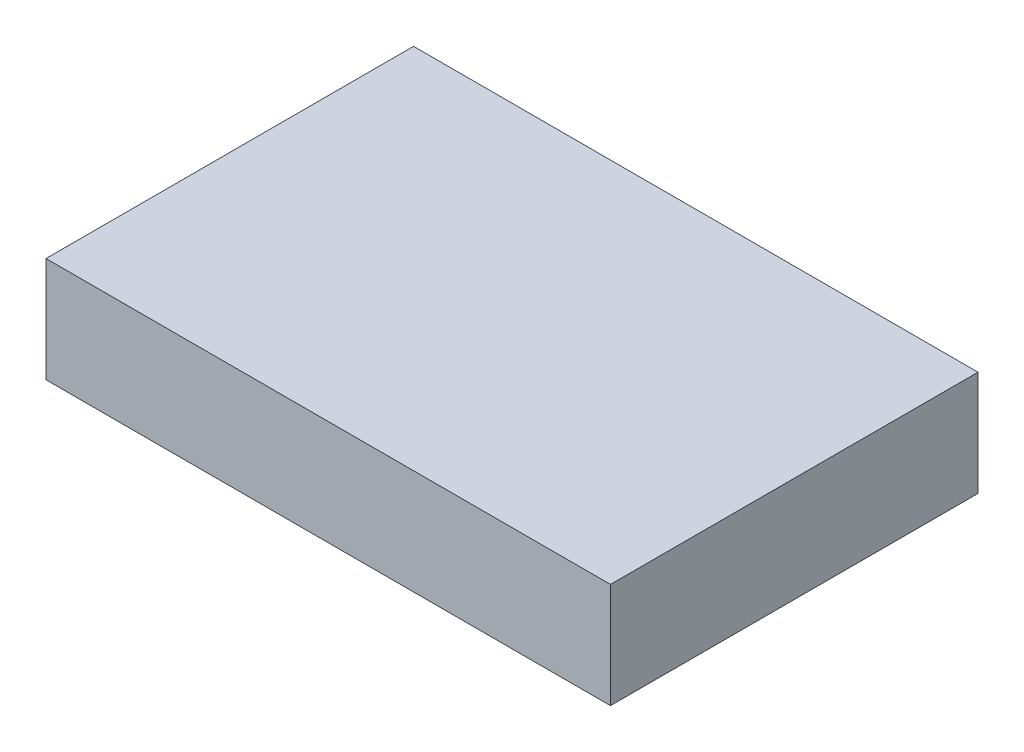
ISO-10303-21;
HEADER;
FILE_DESCRIPTION(('STEP AP214'),'2;1');
FILE_NAME('part.step','',(''),(''),'','','');
FILE_SCHEMA(('AUTOMOTIVE_DESIGN { 1 0 10303 214 1 1 1 1 }'));
ENDSEC;
DATA;
#1=APPLICATION_CONTEXT('core data for automotive mechanical design processes');
#2=APPLICATION_PROTOCOL_DEFINITION('international standard','automotive_design',2000,#1);
#3=PRODUCT_CONTEXT('',#1,'mechanical');
#4=PRODUCT('Part','Part','',(#3));
#5=PRODUCT_RELATED_PRODUCT_CATEGORY('part','',(#4));
#6=PRODUCT_DEFINITION_FORMATION('','',#4);
#7=PRODUCT_DEFINITION_CONTEXT('part definition',#1,'design');
#8=PRODUCT_DEFINITION('design','',#6,#7);
#9=PRODUCT_DEFINITION_SHAPE('','',#8);
#10=(LENGTH_UNIT() NAMED_UNIT(*) SI_UNIT(.MILLI.,.METRE.));
#11=(NAMED_UNIT(*) PLANE_ANGLE_UNIT() SI_UNIT($,.RADIAN.));
#12=(NAMED_UNIT(*) SI_UNIT($,.STERADIAN.) SOLID_ANGLE_UNIT());
#13=UNCERTAINTY_MEASURE_WITH_UNIT(LENGTH_MEASURE(1.E-05),#10,'distance_accuracy_value','');
#14=(GEOMETRIC_REPRESENTATION_CONTEXT(3) GLOBAL_UNCERTAINTY_ASSIGNED_CONTEXT((#13)) GLOBAL_UNIT_ASSIGNED_CONTEXT((#10,
#11,#12)) REPRESENTATION_CONTEXT('',''));
#15=CARTESIAN_POINT('',(0.,0.,0.));
#16=DIRECTION('',(0.,0.,1.));
#17=DIRECTION('',(1.,0.,0.));
#18=AXIS2_PLACEMENT_3D('',#15,#16,#17);
#19=CARTESIAN_POINT('',(68.2625,25.4,44.45));
#20=DIRECTION('',(-1.,0.,0.));
#21=DIRECTION('',(0.,0.,1.));
#22=AXIS2_PLACEMENT_3D('',#19,#20,#21);
#23=PLANE('',#22);
#24=DIRECTION('',(0.,0.,-1.));
#25=VECTOR('',#24,1.);
#26=CARTESIAN_POINT('',(68.2625,0.,44.45));
#27=LINE('',#26,#25);
#28=CARTESIAN_POINT('',(68.2625,0.,44.45));
#29=VERTEX_POINT('',#28);
#30=CARTESIAN_POINT('',(68.2625,0.,-44.45));
#31=VERTEX_POINT('',#30);
#32=EDGE_CURVE('E107',#29,#31,#27,.T.);
#33=ORIENTED_EDGE('',*,*,#32,.T.);
#34=DIRECTION('',(0.,-1.,0.));
#35=VECTOR('',#34,1.);
#36=CARTESIAN_POINT('',(68.2625,25.4,-44.45));
#37=LINE('',#36,#35);
#38=CARTESIAN_POINT('',(68.2625,25.4,-44.45));
#39=VERTEX_POINT('',#38);
#40=EDGE_CURVE('E11',#39,#31,#37,.T.);
#41=ORIENTED_EDGE('',*,*,#40,.F.);
#42=DIRECTION('',(0.,0.,-1.));
#43=VECTOR('',#42,1.);
#44=CARTESIAN_POINT('',(68.2625,25.4,44.45));
#45=LINE('',#44,#43);
#46=CARTESIAN_POINT('',(68.2625,25.4,44.45));
#47=VERTEX_POINT('',#46);
#48=EDGE_CURVE('E91',#47,#39,#45,.T.);
#49=ORIENTED_EDGE('',*,*,#48,.F.);
#50=DIRECTION('',(0.,-1.,0.));
#51=VECTOR('',#50,1.);
#52=CARTESIAN_POINT('',(68.2625,25.4,44.45));
#53=LINE('',#52,#51);
#54=EDGE_CURVE('E103',#47,#29,#53,.T.);
#55=ORIENTED_EDGE('',*,*,#54,.T.);
#56=EDGE_LOOP('',(#33,#41,#49,#55));
#57=FACE_BOUND('',#56,.T.);
#58=ADVANCED_FACE('F39',(#57),#23,.F.);
#59=CARTESIAN_POINT('',(-68.2625,25.4,-44.45));
#60=DIRECTION('',(0.,0.,1.));
#61=DIRECTION('',(1.,0.,0.));
#62=AXIS2_PLACEMENT_3D('',#59,#60,#61);
#63=PLANE('',#62);
#64=DIRECTION('',(-1.,0.,0.));
#65=VECTOR('',#64,1.);
#66=CARTESIAN_POINT('',(-68.2625,0.,-44.45));
#67=LINE('',#66,#65);
#68=CARTESIAN_POINT('',(-68.2625,0.,-44.45));
#69=VERTEX_POINT('',#68);
#70=EDGE_CURVE('E96',#31,#69,#67,.T.);
#71=ORIENTED_EDGE('',*,*,#70,.T.);
#72=DIRECTION('',(0.,-1.,0.));
#73=VECTOR('',#72,1.);
#74=CARTESIAN_POINT('',(-68.2625,25.4,-44.45));
#75=LINE('',#74,#73);
#76=CARTESIAN_POINT('',(-68.2625,25.4,-44.45));
#77=VERTEX_POINT('',#76);
#78=EDGE_CURVE('E48',#77,#69,#75,.T.);
#79=ORIENTED_EDGE('',*,*,#78,.F.);
#80=DIRECTION('',(-1.,0.,0.));
#81=VECTOR('',#80,1.);
#82=CARTESIAN_POINT('',(-68.2625,25.4,-44.45));
#83=LINE('',#82,#81);
#84=EDGE_CURVE('E86',#39,#77,#83,.T.);
#85=ORIENTED_EDGE('',*,*,#84,.F.);
#86=ORIENTED_EDGE('',*,*,#40,.T.);
#87=EDGE_LOOP('',(#71,#79,#85,#86));
#88=FACE_BOUND('',#87,.T.);
#89=ADVANCED_FACE('F95',(#88),#63,.F.);
#90=CARTESIAN_POINT('',(-68.2625,25.4,44.45));
#91=DIRECTION('',(1.,0.,0.));
#92=DIRECTION('',(0.,0.,-1.));
#93=AXIS2_PLACEMENT_3D('',#90,#91,#92);
#94=PLANE('',#93);
#95=DIRECTION('',(0.,0.,1.));
#96=VECTOR('',#95,1.);
#97=CARTESIAN_POINT('',(-68.2625,0.,44.45));
#98=LINE('',#97,#96);
#99=CARTESIAN_POINT('',(-68.2625,0.,44.45));
#100=VERTEX_POINT('',#99);
#101=EDGE_CURVE('E73',#69,#100,#98,.T.);
#102=ORIENTED_EDGE('',*,*,#101,.T.);
#103=DIRECTION('',(0.,-1.,0.));
#104=VECTOR('',#103,1.);
#105=CARTESIAN_POINT('',(-68.2625,25.4,44.45));
#106=LINE('',#105,#104);
#107=CARTESIAN_POINT('',(-68.2625,25.4,44.45));
#108=VERTEX_POINT('',#107);
#109=EDGE_CURVE('E98',#108,#100,#106,.T.);
#110=ORIENTED_EDGE('',*,*,#109,.F.);
#111=DIRECTION('',(0.,0.,1.));
#112=VECTOR('',#111,1.);
#113=CARTESIAN_POINT('',(-68.2625,25.4,44.45));
#114=LINE('',#113,#112);
#115=EDGE_CURVE('E89',#77,#108,#114,.T.);
#116=ORIENTED_EDGE('',*,*,#115,.F.);
#117=ORIENTED_EDGE('',*,*,#78,.T.);
#118=EDGE_LOOP('',(#102,#110,#116,#117));
#119=FACE_BOUND('',#118,.T.);
#120=ADVANCED_FACE('F99',(#119),#94,.F.);
#121=CARTESIAN_POINT('',(-68.2625,25.4,44.45));
#122=DIRECTION('',(0.,0.,-1.));
#123=DIRECTION('',(-1.,0.,0.));
#124=AXIS2_PLACEMENT_3D('',#121,#122,#123);
#125=PLANE('',#124);
#126=DIRECTION('',(1.,0.,0.));
#127=VECTOR('',#126,1.);
#128=CARTESIAN_POINT('',(-68.2625,0.,44.45));
#129=LINE('',#128,#127);
#130=EDGE_CURVE('E79',#100,#29,#129,.T.);
#131=ORIENTED_EDGE('',*,*,#130,.T.);
#132=ORIENTED_EDGE('',*,*,#54,.F.);
#133=DIRECTION('',(1.,0.,0.));
#134=VECTOR('',#133,1.);
#135=CARTESIAN_POINT('',(-68.2625,25.4,44.45));
#136=LINE('',#135,#134);
#137=EDGE_CURVE('E56',#108,#47,#136,.T.);
#138=ORIENTED_EDGE('',*,*,#137,.F.);
#139=ORIENTED_EDGE('',*,*,#109,.T.);
#140=EDGE_LOOP('',(#131,#132,#138,#139));
#141=FACE_BOUND('',#140,.T.);
#142=ADVANCED_FACE('F120',(#141),#125,.F.);
#143=CARTESIAN_POINT('',(0.,25.4,0.));
#144=DIRECTION('',(0.,-1.,0.));
#145=DIRECTION('',(0.,0.,-1.));
#146=AXIS2_PLACEMENT_3D('',#143,#144,#145);
#147=PLANE('',#146);
#148=ORIENTED_EDGE('',*,*,#48,.T.);
#149=ORIENTED_EDGE('',*,*,#84,.T.);
#150=ORIENTED_EDGE('',*,*,#115,.T.);
#151=ORIENTED_EDGE('',*,*,#137,.T.);
#152=EDGE_LOOP('',(#148,#149,#150,#151));
#153=FACE_BOUND('',#152,.T.);
#154=ADVANCED_FACE('F87',(#153),#147,.F.);
#155=CARTESIAN_POINT('',(0.,0.,0.));
#156=DIRECTION('',(0.,-1.,0.));
#157=DIRECTION('',(0.,0.,-1.));
#158=AXIS2_PLACEMENT_3D('',#155,#156,#157);
#159=PLANE('',#158);
#160=ORIENTED_EDGE('',*,*,#32,.F.);
#161=ORIENTED_EDGE('',*,*,#130,.F.);
#162=ORIENTED_EDGE('',*,*,#101,.F.);
#163=ORIENTED_EDGE('',*,*,#70,.F.);
#164=EDGE_LOOP('',(#160,#161,#162,#163));
#165=FACE_BOUND('',#164,.T.);
#166=ADVANCED_FACE('F123',(#165),#159,.T.);
#167=CLOSED_SHELL('',(#58,#89,#120,#142,#154,#166));
#168=MANIFOLD_SOLID_BREP('B2',#167);
#169=ADVANCED_BREP_SHAPE_REPRESENTATION('',(#18,#168),#14);
#170=SHAPE_DEFINITION_REPRESENTATION(#9,#169);
ENDSEC;
END-ISO-10303-21;
